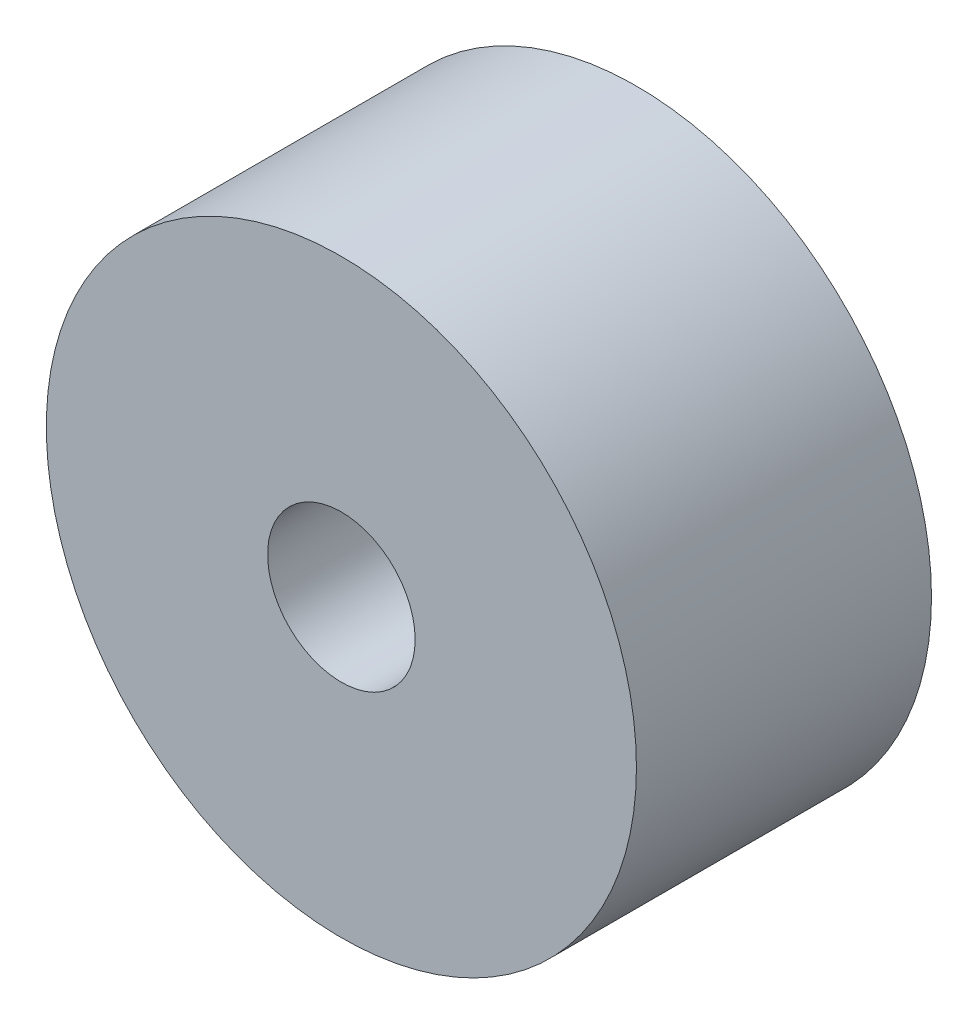
ISO-10303-21;
HEADER;
FILE_DESCRIPTION(('STEP AP214'),'2;1');
FILE_NAME('part.step','',(''),(''),'','','');
FILE_SCHEMA(('AUTOMOTIVE_DESIGN { 1 0 10303 214 1 1 1 1 }'));
ENDSEC;
DATA;
#1=APPLICATION_CONTEXT('core data for automotive mechanical design processes');
#2=APPLICATION_PROTOCOL_DEFINITION('international standard','automotive_design',2000,#1);
#3=PRODUCT_CONTEXT('',#1,'mechanical');
#4=PRODUCT('Part','Part','',(#3));
#5=PRODUCT_RELATED_PRODUCT_CATEGORY('part','',(#4));
#6=PRODUCT_DEFINITION_FORMATION('','',#4);
#7=PRODUCT_DEFINITION_CONTEXT('part definition',#1,'design');
#8=PRODUCT_DEFINITION('design','',#6,#7);
#9=PRODUCT_DEFINITION_SHAPE('','',#8);
#10=(LENGTH_UNIT() NAMED_UNIT(*) SI_UNIT(.MILLI.,.METRE.));
#11=(NAMED_UNIT(*) PLANE_ANGLE_UNIT() SI_UNIT($,.RADIAN.));
#12=(NAMED_UNIT(*) SI_UNIT($,.STERADIAN.) SOLID_ANGLE_UNIT());
#13=UNCERTAINTY_MEASURE_WITH_UNIT(LENGTH_MEASURE(1.E-05),#10,'distance_accuracy_value','');
#14=(GEOMETRIC_REPRESENTATION_CONTEXT(3) GLOBAL_UNCERTAINTY_ASSIGNED_CONTEXT((#13)) GLOBAL_UNIT_ASSIGNED_CONTEXT((#10,
#11,#12)) REPRESENTATION_CONTEXT('',''));
#15=CARTESIAN_POINT('',(0.,0.,0.));
#16=DIRECTION('',(0.,0.,1.));
#17=DIRECTION('',(1.,0.,0.));
#18=AXIS2_PLACEMENT_3D('',#15,#16,#17);
#19=CARTESIAN_POINT('',(0.,0.,12.7));
#20=DIRECTION('',(0.,0.,1.));
#21=DIRECTION('',(1.,0.,0.));
#22=AXIS2_PLACEMENT_3D('',#19,#20,#21);
#23=PLANE('',#22);
#24=CARTESIAN_POINT('',(0.,0.,12.7));
#25=DIRECTION('',(0.,0.,1.));
#26=DIRECTION('',(1.,0.,0.));
#27=AXIS2_PLACEMENT_3D('',#24,#25,#26);
#28=CIRCLE('',#27,12.7);
#29=CARTESIAN_POINT('',(12.7,0.,12.7));
#30=VERTEX_POINT('',#29);
#31=EDGE_CURVE('E10',#30,#30,#28,.T.);
#32=ORIENTED_EDGE('',*,*,#31,.T.);
#33=EDGE_LOOP('',(#32));
#34=FACE_BOUND('',#33,.T.);
#35=CARTESIAN_POINT('',(0.,0.,12.7));
#36=DIRECTION('',(0.,0.,1.));
#37=DIRECTION('',(1.,0.,0.));
#38=AXIS2_PLACEMENT_3D('',#35,#36,#37);
#39=CIRCLE('',#38,3.175);
#40=CARTESIAN_POINT('',(3.175,0.,12.7));
#41=VERTEX_POINT('',#40);
#42=EDGE_CURVE('E54',#41,#41,#39,.T.);
#43=ORIENTED_EDGE('',*,*,#42,.F.);
#44=EDGE_LOOP('',(#43));
#45=FACE_BOUND('',#44,.T.);
#46=ADVANCED_FACE('F41',(#34,#45),#23,.T.);
#47=CARTESIAN_POINT('',(0.,0.,0.));
#48=DIRECTION('',(0.,0.,1.));
#49=DIRECTION('',(1.,0.,0.));
#50=AXIS2_PLACEMENT_3D('',#47,#48,#49);
#51=PLANE('',#50);
#52=CARTESIAN_POINT('',(0.,0.,0.));
#53=DIRECTION('',(0.,0.,1.));
#54=DIRECTION('',(1.,0.,0.));
#55=AXIS2_PLACEMENT_3D('',#52,#53,#54);
#56=CIRCLE('',#55,12.7);
#57=CARTESIAN_POINT('',(12.7,0.,0.));
#58=VERTEX_POINT('',#57);
#59=EDGE_CURVE('E45',#58,#58,#56,.T.);
#60=ORIENTED_EDGE('',*,*,#59,.F.);
#61=EDGE_LOOP('',(#60));
#62=FACE_BOUND('',#61,.T.);
#63=CARTESIAN_POINT('',(0.,0.,0.));
#64=DIRECTION('',(0.,0.,1.));
#65=DIRECTION('',(1.,0.,0.));
#66=AXIS2_PLACEMENT_3D('',#63,#64,#65);
#67=CIRCLE('',#66,3.175);
#68=CARTESIAN_POINT('',(3.175,0.,0.));
#69=VERTEX_POINT('',#68);
#70=EDGE_CURVE('E56',#69,#69,#67,.T.);
#71=ORIENTED_EDGE('',*,*,#70,.T.);
#72=EDGE_LOOP('',(#71));
#73=FACE_BOUND('',#72,.T.);
#74=ADVANCED_FACE('F68',(#62,#73),#51,.F.);
#75=CARTESIAN_POINT('',(0.,0.,12.7));
#76=DIRECTION('',(0.,0.,-1.));
#77=DIRECTION('',(-1.,0.,0.));
#78=AXIS2_PLACEMENT_3D('',#75,#76,#77);
#79=CYLINDRICAL_SURFACE('',#78,12.7);
#80=ORIENTED_EDGE('',*,*,#31,.F.);
#81=EDGE_LOOP('',(#80));
#82=FACE_BOUND('',#81,.T.);
#83=ORIENTED_EDGE('',*,*,#59,.T.);
#84=EDGE_LOOP('',(#83));
#85=FACE_BOUND('',#84,.T.);
#86=ADVANCED_FACE('F43',(#82,#85),#79,.T.);
#87=CARTESIAN_POINT('',(0.,0.,12.7));
#88=DIRECTION('',(0.,0.,-1.));
#89=DIRECTION('',(-1.,0.,0.));
#90=AXIS2_PLACEMENT_3D('',#87,#88,#89);
#91=CYLINDRICAL_SURFACE('',#90,3.175);
#92=ORIENTED_EDGE('',*,*,#42,.T.);
#93=EDGE_LOOP('',(#92));
#94=FACE_BOUND('',#93,.T.);
#95=ORIENTED_EDGE('',*,*,#70,.F.);
#96=EDGE_LOOP('',(#95));
#97=FACE_BOUND('',#96,.T.);
#98=ADVANCED_FACE('F64',(#94,#97),#91,.F.);
#99=CLOSED_SHELL('',(#46,#74,#86,#98));
#100=MANIFOLD_SOLID_BREP('B2',#99);
#101=ADVANCED_BREP_SHAPE_REPRESENTATION('',(#18,#100),#14);
#102=SHAPE_DEFINITION_REPRESENTATION(#9,#101);
ENDSEC;
END-ISO-10303-21;
